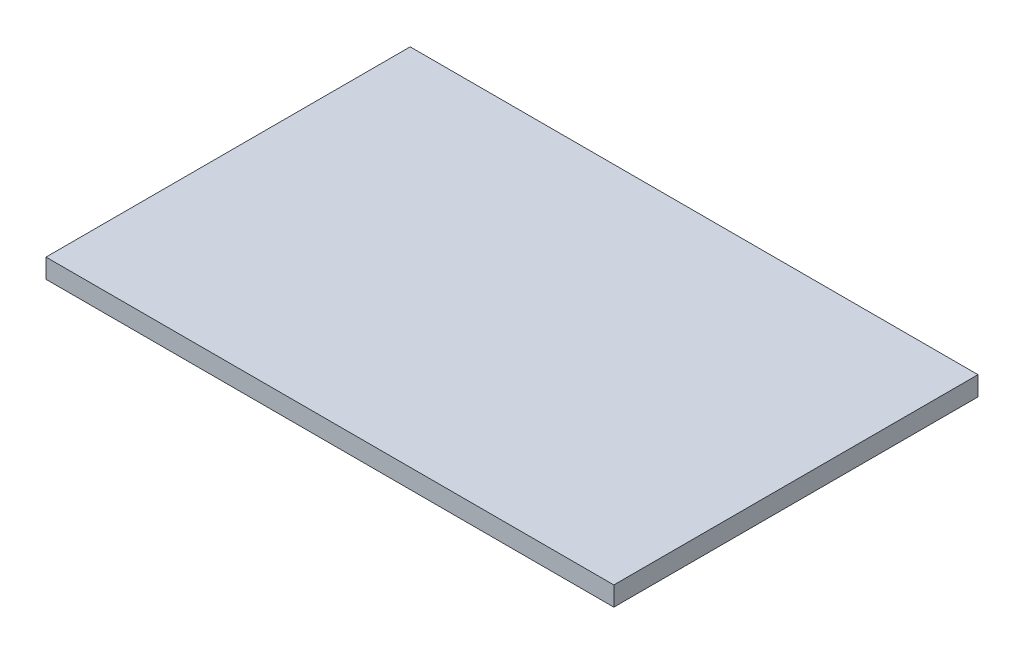
ISO-10303-21;
HEADER;
FILE_DESCRIPTION(('STEP AP214'),'2;1');
FILE_NAME('part.step','',(''),(''),'','','');
FILE_SCHEMA(('AUTOMOTIVE_DESIGN { 1 0 10303 214 1 1 1 1 }'));
ENDSEC;
DATA;
#1=APPLICATION_CONTEXT('core data for automotive mechanical design processes');
#2=APPLICATION_PROTOCOL_DEFINITION('international standard','automotive_design',2000,#1);
#3=PRODUCT_CONTEXT('',#1,'mechanical');
#4=PRODUCT('Part','Part','',(#3));
#5=PRODUCT_RELATED_PRODUCT_CATEGORY('part','',(#4));
#6=PRODUCT_DEFINITION_FORMATION('','',#4);
#7=PRODUCT_DEFINITION_CONTEXT('part definition',#1,'design');
#8=PRODUCT_DEFINITION('design','',#6,#7);
#9=PRODUCT_DEFINITION_SHAPE('','',#8);
#10=(LENGTH_UNIT() NAMED_UNIT(*) SI_UNIT(.MILLI.,.METRE.));
#11=(NAMED_UNIT(*) PLANE_ANGLE_UNIT() SI_UNIT($,.RADIAN.));
#12=(NAMED_UNIT(*) SI_UNIT($,.STERADIAN.) SOLID_ANGLE_UNIT());
#13=UNCERTAINTY_MEASURE_WITH_UNIT(LENGTH_MEASURE(1.E-05),#10,'distance_accuracy_value','');
#14=(GEOMETRIC_REPRESENTATION_CONTEXT(3) GLOBAL_UNCERTAINTY_ASSIGNED_CONTEXT((#13)) GLOBAL_UNIT_ASSIGNED_CONTEXT((#10,
#11,#12)) REPRESENTATION_CONTEXT('',''));
#15=CARTESIAN_POINT('',(0.,0.,0.));
#16=DIRECTION('',(0.,0.,1.));
#17=DIRECTION('',(1.,0.,0.));
#18=AXIS2_PLACEMENT_3D('',#15,#16,#17);
#19=CARTESIAN_POINT('',(0.,15.875,0.));
#20=DIRECTION('',(1.,0.,0.));
#21=DIRECTION('',(0.,0.,-1.));
#22=AXIS2_PLACEMENT_3D('',#19,#20,#21);
#23=PLANE('',#22);
#24=DIRECTION('',(0.,0.,1.));
#25=VECTOR('',#24,1.);
#26=CARTESIAN_POINT('',(0.,0.,0.));
#27=LINE('',#26,#25);
#28=CARTESIAN_POINT('',(0.,0.,-299.72));
#29=VERTEX_POINT('',#28);
#30=CARTESIAN_POINT('',(0.,0.,0.));
#31=VERTEX_POINT('',#30);
#32=EDGE_CURVE('E93',#29,#31,#27,.T.);
#33=ORIENTED_EDGE('',*,*,#32,.T.);
#34=DIRECTION('',(0.,-1.,0.));
#35=VECTOR('',#34,1.);
#36=CARTESIAN_POINT('',(0.,15.875,0.));
#37=LINE('',#36,#35);
#38=CARTESIAN_POINT('',(0.,15.875,0.));
#39=VERTEX_POINT('',#38);
#40=EDGE_CURVE('E11',#39,#31,#37,.T.);
#41=ORIENTED_EDGE('',*,*,#40,.F.);
#42=DIRECTION('',(0.,0.,1.));
#43=VECTOR('',#42,1.);
#44=CARTESIAN_POINT('',(0.,15.875,0.));
#45=LINE('',#44,#43);
#46=CARTESIAN_POINT('',(0.,15.875,-299.72));
#47=VERTEX_POINT('',#46);
#48=EDGE_CURVE('E81',#47,#39,#45,.T.);
#49=ORIENTED_EDGE('',*,*,#48,.F.);
#50=DIRECTION('',(0.,-1.,0.));
#51=VECTOR('',#50,1.);
#52=CARTESIAN_POINT('',(0.,15.875,-299.72));
#53=LINE('',#52,#51);
#54=EDGE_CURVE('E89',#47,#29,#53,.T.);
#55=ORIENTED_EDGE('',*,*,#54,.T.);
#56=EDGE_LOOP('',(#33,#41,#49,#55));
#57=FACE_BOUND('',#56,.T.);
#58=ADVANCED_FACE('F30',(#57),#23,.F.);
#59=CARTESIAN_POINT('',(0.,15.875,0.));
#60=DIRECTION('',(0.,0.,-1.));
#61=DIRECTION('',(-1.,0.,0.));
#62=AXIS2_PLACEMENT_3D('',#59,#60,#61);
#63=PLANE('',#62);
#64=DIRECTION('',(1.,0.,0.));
#65=VECTOR('',#64,1.);
#66=CARTESIAN_POINT('',(0.,0.,0.));
#67=LINE('',#66,#65);
#68=CARTESIAN_POINT('',(467.36,0.,0.));
#69=VERTEX_POINT('',#68);
#70=EDGE_CURVE('E85',#31,#69,#67,.T.);
#71=ORIENTED_EDGE('',*,*,#70,.T.);
#72=DIRECTION('',(0.,-1.,0.));
#73=VECTOR('',#72,1.);
#74=CARTESIAN_POINT('',(467.36,15.875,0.));
#75=LINE('',#74,#73);
#76=CARTESIAN_POINT('',(467.36,15.875,0.));
#77=VERTEX_POINT('',#76);
#78=EDGE_CURVE('E38',#77,#69,#75,.T.);
#79=ORIENTED_EDGE('',*,*,#78,.F.);
#80=DIRECTION('',(1.,0.,0.));
#81=VECTOR('',#80,1.);
#82=CARTESIAN_POINT('',(0.,15.875,0.));
#83=LINE('',#82,#81);
#84=EDGE_CURVE('E76',#39,#77,#83,.T.);
#85=ORIENTED_EDGE('',*,*,#84,.F.);
#86=ORIENTED_EDGE('',*,*,#40,.T.);
#87=EDGE_LOOP('',(#71,#79,#85,#86));
#88=FACE_BOUND('',#87,.T.);
#89=ADVANCED_FACE('F84',(#88),#63,.F.);
#90=CARTESIAN_POINT('',(467.36,15.875,0.));
#91=DIRECTION('',(-1.,0.,0.));
#92=DIRECTION('',(0.,0.,1.));
#93=AXIS2_PLACEMENT_3D('',#90,#91,#92);
#94=PLANE('',#93);
#95=DIRECTION('',(0.,0.,-1.));
#96=VECTOR('',#95,1.);
#97=CARTESIAN_POINT('',(467.36,0.,0.));
#98=LINE('',#97,#96);
#99=CARTESIAN_POINT('',(467.36,0.,-299.72));
#100=VERTEX_POINT('',#99);
#101=EDGE_CURVE('E63',#69,#100,#98,.T.);
#102=ORIENTED_EDGE('',*,*,#101,.T.);
#103=DIRECTION('',(0.,-1.,0.));
#104=VECTOR('',#103,1.);
#105=CARTESIAN_POINT('',(467.36,15.875,-299.72));
#106=LINE('',#105,#104);
#107=CARTESIAN_POINT('',(467.36,15.875,-299.72));
#108=VERTEX_POINT('',#107);
#109=EDGE_CURVE('E86',#108,#100,#106,.T.);
#110=ORIENTED_EDGE('',*,*,#109,.F.);
#111=DIRECTION('',(0.,0.,-1.));
#112=VECTOR('',#111,1.);
#113=CARTESIAN_POINT('',(467.36,15.875,0.));
#114=LINE('',#113,#112);
#115=EDGE_CURVE('E79',#77,#108,#114,.T.);
#116=ORIENTED_EDGE('',*,*,#115,.F.);
#117=ORIENTED_EDGE('',*,*,#78,.T.);
#118=EDGE_LOOP('',(#102,#110,#116,#117));
#119=FACE_BOUND('',#118,.T.);
#120=ADVANCED_FACE('F87',(#119),#94,.F.);
#121=CARTESIAN_POINT('',(0.,15.875,-299.72));
#122=DIRECTION('',(0.,0.,1.));
#123=DIRECTION('',(1.,0.,0.));
#124=AXIS2_PLACEMENT_3D('',#121,#122,#123);
#125=PLANE('',#124);
#126=DIRECTION('',(-1.,0.,0.));
#127=VECTOR('',#126,1.);
#128=CARTESIAN_POINT('',(0.,0.,-299.72));
#129=LINE('',#128,#127);
#130=EDGE_CURVE('E69',#100,#29,#129,.T.);
#131=ORIENTED_EDGE('',*,*,#130,.T.);
#132=ORIENTED_EDGE('',*,*,#54,.F.);
#133=DIRECTION('',(-1.,0.,0.));
#134=VECTOR('',#133,1.);
#135=CARTESIAN_POINT('',(0.,15.875,-299.72));
#136=LINE('',#135,#134);
#137=EDGE_CURVE('E46',#108,#47,#136,.T.);
#138=ORIENTED_EDGE('',*,*,#137,.F.);
#139=ORIENTED_EDGE('',*,*,#109,.T.);
#140=EDGE_LOOP('',(#131,#132,#138,#139));
#141=FACE_BOUND('',#140,.T.);
#142=ADVANCED_FACE('F100',(#141),#125,.F.);
#143=CARTESIAN_POINT('',(0.,15.875,-299.72));
#144=DIRECTION('',(0.,-1.,0.));
#145=DIRECTION('',(0.,0.,-1.));
#146=AXIS2_PLACEMENT_3D('',#143,#144,#145);
#147=PLANE('',#146);
#148=ORIENTED_EDGE('',*,*,#48,.T.);
#149=ORIENTED_EDGE('',*,*,#84,.T.);
#150=ORIENTED_EDGE('',*,*,#115,.T.);
#151=ORIENTED_EDGE('',*,*,#137,.T.);
#152=EDGE_LOOP('',(#148,#149,#150,#151));
#153=FACE_BOUND('',#152,.T.);
#154=ADVANCED_FACE('F77',(#153),#147,.F.);
#155=CARTESIAN_POINT('',(0.,0.,-299.72));
#156=DIRECTION('',(0.,-1.,0.));
#157=DIRECTION('',(0.,0.,-1.));
#158=AXIS2_PLACEMENT_3D('',#155,#156,#157);
#159=PLANE('',#158);
#160=ORIENTED_EDGE('',*,*,#32,.F.);
#161=ORIENTED_EDGE('',*,*,#130,.F.);
#162=ORIENTED_EDGE('',*,*,#101,.F.);
#163=ORIENTED_EDGE('',*,*,#70,.F.);
#164=EDGE_LOOP('',(#160,#161,#162,#163));
#165=FACE_BOUND('',#164,.T.);
#166=ADVANCED_FACE('F103',(#165),#159,.T.);
#167=CLOSED_SHELL('',(#58,#89,#120,#142,#154,#166));
#168=MANIFOLD_SOLID_BREP('B2',#167);
#169=ADVANCED_BREP_SHAPE_REPRESENTATION('',(#18,#168),#14);
#170=SHAPE_DEFINITION_REPRESENTATION(#9,#169);
ENDSEC;
END-ISO-10303-21;
